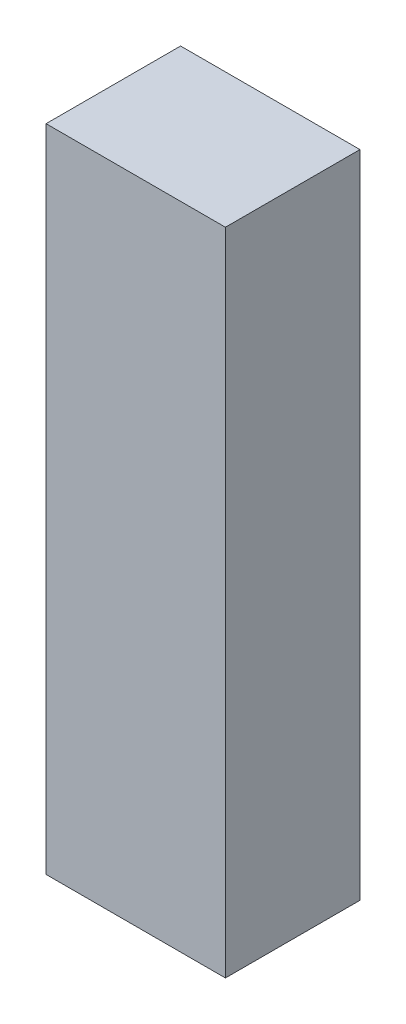
ISO-10303-21;
HEADER;
FILE_DESCRIPTION(('STEP AP214'),'2;1');
FILE_NAME('part.step','',(''),(''),'','','');
FILE_SCHEMA(('AUTOMOTIVE_DESIGN { 1 0 10303 214 1 1 1 1 }'));
ENDSEC;
DATA;
#1=APPLICATION_CONTEXT('core data for automotive mechanical design processes');
#2=APPLICATION_PROTOCOL_DEFINITION('international standard','automotive_design',2000,#1);
#3=PRODUCT_CONTEXT('',#1,'mechanical');
#4=PRODUCT('Part','Part','',(#3));
#5=PRODUCT_RELATED_PRODUCT_CATEGORY('part','',(#4));
#6=PRODUCT_DEFINITION_FORMATION('','',#4);
#7=PRODUCT_DEFINITION_CONTEXT('part definition',#1,'design');
#8=PRODUCT_DEFINITION('design','',#6,#7);
#9=PRODUCT_DEFINITION_SHAPE('','',#8);
#10=(LENGTH_UNIT() NAMED_UNIT(*) SI_UNIT(.MILLI.,.METRE.));
#11=(NAMED_UNIT(*) PLANE_ANGLE_UNIT() SI_UNIT($,.RADIAN.));
#12=(NAMED_UNIT(*) SI_UNIT($,.STERADIAN.) SOLID_ANGLE_UNIT());
#13=UNCERTAINTY_MEASURE_WITH_UNIT(LENGTH_MEASURE(1.E-05),#10,'distance_accuracy_value','');
#14=(GEOMETRIC_REPRESENTATION_CONTEXT(3) GLOBAL_UNCERTAINTY_ASSIGNED_CONTEXT((#13)) GLOBAL_UNIT_ASSIGNED_CONTEXT((#10,
#11,#12)) REPRESENTATION_CONTEXT('',''));
#15=CARTESIAN_POINT('',(0.,0.,0.));
#16=DIRECTION('',(0.,0.,1.));
#17=DIRECTION('',(1.,0.,0.));
#18=AXIS2_PLACEMENT_3D('',#15,#16,#17);
#19=CARTESIAN_POINT('',(0.3,0.,0.950000011921));
#20=DIRECTION('',(0.,0.,1.));
#21=DIRECTION('',(1.,0.,0.));
#22=AXIS2_PLACEMENT_3D('',#19,#20,#21);
#23=PLANE('',#22);
#24=DIRECTION('',(0.,1.,0.));
#25=VECTOR('',#24,1.);
#26=CARTESIAN_POINT('',(0.70000000596,0.,0.950000011921));
#27=LINE('',#26,#25);
#28=CARTESIAN_POINT('',(0.70000000596,1.450000047684,0.950000011921));
#29=VERTEX_POINT('',#28);
#30=CARTESIAN_POINT('',(0.70000000596,0.,0.950000011921));
#31=VERTEX_POINT('',#30);
#32=EDGE_CURVE('E77',#29,#31,#27,.F.);
#33=ORIENTED_EDGE('',*,*,#32,.F.);
#34=DIRECTION('',(1.,0.,0.));
#35=VECTOR('',#34,1.);
#36=CARTESIAN_POINT('',(0.3,1.450000047684,0.950000011921));
#37=LINE('',#36,#35);
#38=CARTESIAN_POINT('',(0.3,1.450000047684,0.950000011921));
#39=VERTEX_POINT('',#38);
#40=EDGE_CURVE('E20',#29,#39,#37,.F.);
#41=ORIENTED_EDGE('',*,*,#40,.T.);
#42=DIRECTION('',(0.,1.,0.));
#43=VECTOR('',#42,1.);
#44=CARTESIAN_POINT('',(0.3,0.,0.950000011921));
#45=LINE('',#44,#43);
#46=CARTESIAN_POINT('',(0.3,0.,0.950000011921));
#47=VERTEX_POINT('',#46);
#48=EDGE_CURVE('E58',#39,#47,#45,.F.);
#49=ORIENTED_EDGE('',*,*,#48,.T.);
#50=DIRECTION('',(1.,0.,0.));
#51=VECTOR('',#50,1.);
#52=CARTESIAN_POINT('',(0.3,0.,0.950000011921));
#53=LINE('',#52,#51);
#54=EDGE_CURVE('E55',#47,#31,#53,.T.);
#55=ORIENTED_EDGE('',*,*,#54,.T.);
#56=EDGE_LOOP('',(#33,#41,#49,#55));
#57=FACE_BOUND('',#56,.T.);
#58=ADVANCED_FACE('F17',(#57),#23,.T.);
#59=CARTESIAN_POINT('',(0.3,0.,0.65));
#60=DIRECTION('',(1.,0.,0.));
#61=DIRECTION('',(0.,0.,-1.));
#62=AXIS2_PLACEMENT_3D('',#59,#60,#61);
#63=PLANE('',#62);
#64=DIRECTION('',(0.,0.,1.));
#65=VECTOR('',#64,1.);
#66=CARTESIAN_POINT('',(0.3,1.450000047684,0.65));
#67=LINE('',#66,#65);
#68=CARTESIAN_POINT('',(0.3,1.450000047684,0.65));
#69=VERTEX_POINT('',#68);
#70=EDGE_CURVE('E79',#69,#39,#67,.T.);
#71=ORIENTED_EDGE('',*,*,#70,.F.);
#72=DIRECTION('',(0.,1.,0.));
#73=VECTOR('',#72,1.);
#74=CARTESIAN_POINT('',(0.3,0.,0.65));
#75=LINE('',#74,#73);
#76=CARTESIAN_POINT('',(0.3,0.,0.65));
#77=VERTEX_POINT('',#76);
#78=EDGE_CURVE('E73',#69,#77,#75,.F.);
#79=ORIENTED_EDGE('',*,*,#78,.T.);
#80=DIRECTION('',(0.,0.,1.));
#81=VECTOR('',#80,1.);
#82=CARTESIAN_POINT('',(0.3,0.,0.65));
#83=LINE('',#82,#81);
#84=EDGE_CURVE('E63',#77,#47,#83,.T.);
#85=ORIENTED_EDGE('',*,*,#84,.T.);
#86=ORIENTED_EDGE('',*,*,#48,.F.);
#87=EDGE_LOOP('',(#71,#79,#85,#86));
#88=FACE_BOUND('',#87,.T.);
#89=ADVANCED_FACE('F72',(#88),#63,.F.);
#90=CARTESIAN_POINT('',(0.3,0.,0.65));
#91=DIRECTION('',(0.,1.,0.));
#92=DIRECTION('',(0.,0.,1.));
#93=AXIS2_PLACEMENT_3D('',#90,#91,#92);
#94=PLANE('',#93);
#95=ORIENTED_EDGE('',*,*,#54,.F.);
#96=ORIENTED_EDGE('',*,*,#84,.F.);
#97=DIRECTION('',(1.,0.,0.));
#98=VECTOR('',#97,1.);
#99=CARTESIAN_POINT('',(0.3,0.,0.65));
#100=LINE('',#99,#98);
#101=CARTESIAN_POINT('',(0.70000000596,0.,0.65));
#102=VERTEX_POINT('',#101);
#103=EDGE_CURVE('E83',#77,#102,#100,.T.);
#104=ORIENTED_EDGE('',*,*,#103,.T.);
#105=DIRECTION('',(0.,0.,-1.));
#106=VECTOR('',#105,1.);
#107=CARTESIAN_POINT('',(0.70000000596,0.,0.65));
#108=LINE('',#107,#106);
#109=EDGE_CURVE('E69',#31,#102,#108,.T.);
#110=ORIENTED_EDGE('',*,*,#109,.F.);
#111=EDGE_LOOP('',(#95,#96,#104,#110));
#112=FACE_BOUND('',#111,.T.);
#113=ADVANCED_FACE('F66',(#112),#94,.F.);
#114=CARTESIAN_POINT('',(0.70000000596,0.,0.65));
#115=DIRECTION('',(1.,0.,0.));
#116=DIRECTION('',(0.,0.,-1.));
#117=AXIS2_PLACEMENT_3D('',#114,#115,#116);
#118=PLANE('',#117);
#119=DIRECTION('',(0.,0.,1.));
#120=VECTOR('',#119,1.);
#121=CARTESIAN_POINT('',(0.70000000596,1.450000047684,0.65));
#122=LINE('',#121,#120);
#123=CARTESIAN_POINT('',(0.70000000596,1.450000047684,0.65));
#124=VERTEX_POINT('',#123);
#125=EDGE_CURVE('E34',#29,#124,#122,.F.);
#126=ORIENTED_EDGE('',*,*,#125,.F.);
#127=ORIENTED_EDGE('',*,*,#32,.T.);
#128=ORIENTED_EDGE('',*,*,#109,.T.);
#129=DIRECTION('',(0.,1.,0.));
#130=VECTOR('',#129,1.);
#131=CARTESIAN_POINT('',(0.70000000596,0.,0.65));
#132=LINE('',#131,#130);
#133=EDGE_CURVE('E26',#102,#124,#132,.T.);
#134=ORIENTED_EDGE('',*,*,#133,.T.);
#135=EDGE_LOOP('',(#126,#127,#128,#134));
#136=FACE_BOUND('',#135,.T.);
#137=ADVANCED_FACE('F88',(#136),#118,.T.);
#138=CARTESIAN_POINT('',(0.3,1.450000047684,0.65));
#139=DIRECTION('',(0.,1.,0.));
#140=DIRECTION('',(0.,0.,1.));
#141=AXIS2_PLACEMENT_3D('',#138,#139,#140);
#142=PLANE('',#141);
#143=ORIENTED_EDGE('',*,*,#40,.F.);
#144=ORIENTED_EDGE('',*,*,#125,.T.);
#145=DIRECTION('',(1.,0.,0.));
#146=VECTOR('',#145,1.);
#147=CARTESIAN_POINT('',(0.3,1.450000047684,0.65));
#148=LINE('',#147,#146);
#149=EDGE_CURVE('E11',#124,#69,#148,.F.);
#150=ORIENTED_EDGE('',*,*,#149,.T.);
#151=ORIENTED_EDGE('',*,*,#70,.T.);
#152=EDGE_LOOP('',(#143,#144,#150,#151));
#153=FACE_BOUND('',#152,.T.);
#154=ADVANCED_FACE('F91',(#153),#142,.T.);
#155=CARTESIAN_POINT('',(0.3,0.,0.65));
#156=DIRECTION('',(0.,0.,1.));
#157=DIRECTION('',(1.,0.,0.));
#158=AXIS2_PLACEMENT_3D('',#155,#156,#157);
#159=PLANE('',#158);
#160=ORIENTED_EDGE('',*,*,#133,.F.);
#161=ORIENTED_EDGE('',*,*,#103,.F.);
#162=ORIENTED_EDGE('',*,*,#78,.F.);
#163=ORIENTED_EDGE('',*,*,#149,.F.);
#164=EDGE_LOOP('',(#160,#161,#162,#163));
#165=FACE_BOUND('',#164,.T.);
#166=ADVANCED_FACE('F90',(#165),#159,.F.);
#167=CLOSED_SHELL('',(#58,#89,#113,#137,#154,#166));
#168=MANIFOLD_SOLID_BREP('B1',#167);
#169=ADVANCED_BREP_SHAPE_REPRESENTATION('',(#18,#168),#14);
#170=SHAPE_DEFINITION_REPRESENTATION(#9,#169);
ENDSEC;
END-ISO-10303-21;
